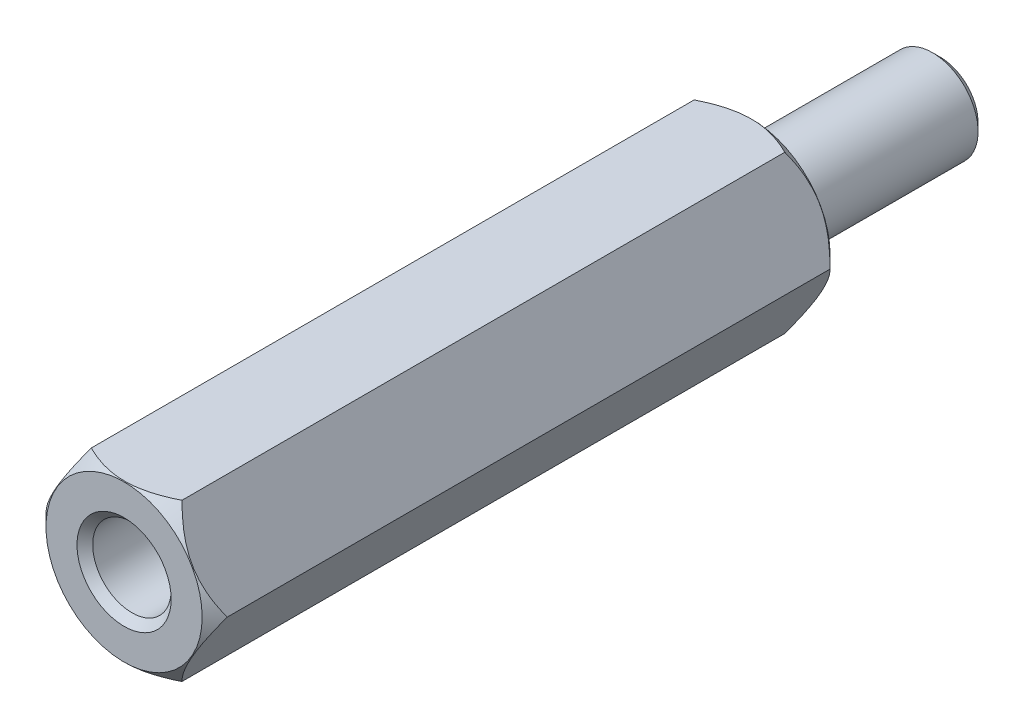
ISO-10303-21;
HEADER;
FILE_DESCRIPTION(('STEP AP214'),'2;1');
FILE_NAME('part.step','',(''),(''),'','','');
FILE_SCHEMA(('AUTOMOTIVE_DESIGN { 1 0 10303 214 1 1 1 1 }'));
ENDSEC;
DATA;
#1=APPLICATION_CONTEXT('core data for automotive mechanical design processes');
#2=APPLICATION_PROTOCOL_DEFINITION('international standard','automotive_design',2000,#1);
#3=PRODUCT_CONTEXT('',#1,'mechanical');
#4=PRODUCT('Part','Part','',(#3));
#5=PRODUCT_RELATED_PRODUCT_CATEGORY('part','',(#4));
#6=PRODUCT_DEFINITION_FORMATION('','',#4);
#7=PRODUCT_DEFINITION_CONTEXT('part definition',#1,'design');
#8=PRODUCT_DEFINITION('design','',#6,#7);
#9=PRODUCT_DEFINITION_SHAPE('','',#8);
#10=(LENGTH_UNIT() NAMED_UNIT(*) SI_UNIT(.MILLI.,.METRE.));
#11=(NAMED_UNIT(*) PLANE_ANGLE_UNIT() SI_UNIT($,.RADIAN.));
#12=(NAMED_UNIT(*) SI_UNIT($,.STERADIAN.) SOLID_ANGLE_UNIT());
#13=UNCERTAINTY_MEASURE_WITH_UNIT(LENGTH_MEASURE(1.E-05),#10,'distance_accuracy_value','');
#14=(GEOMETRIC_REPRESENTATION_CONTEXT(3) GLOBAL_UNCERTAINTY_ASSIGNED_CONTEXT((#13)) GLOBAL_UNIT_ASSIGNED_CONTEXT((#10,
#11,#12)) REPRESENTATION_CONTEXT('',''));
#15=CARTESIAN_POINT('',(0.,0.,0.));
#16=DIRECTION('',(0.,0.,1.));
#17=DIRECTION('',(1.,0.,0.));
#18=AXIS2_PLACEMENT_3D('',#15,#16,#17);
#19=CARTESIAN_POINT('',(0.,0.,10.));
#20=DIRECTION('',(0.,0.,1.));
#21=DIRECTION('',(1.,0.,0.));
#22=AXIS2_PLACEMENT_3D('',#19,#20,#21);
#23=CYLINDRICAL_SURFACE('',#22,1.24999999999999);
#24=CARTESIAN_POINT('',(0.,0.,9.75000000000001));
#25=DIRECTION('',(0.,0.,1.));
#26=DIRECTION('',(1.,0.,0.));
#27=AXIS2_PLACEMENT_3D('',#24,#25,#26);
#28=CIRCLE('',#27,1.24999999999999);
#29=CARTESIAN_POINT('',(1.24999999999999,0.,9.75000000000001));
#30=VERTEX_POINT('',#29);
#31=EDGE_CURVE('E51',#30,#30,#28,.T.);
#32=ORIENTED_EDGE('',*,*,#31,.T.);
#33=EDGE_LOOP('',(#32));
#34=FACE_BOUND('',#33,.T.);
#35=CARTESIAN_POINT('',(0.,0.,-8.));
#36=DIRECTION('',(0.,0.,-1.));
#37=DIRECTION('',(-1.,0.,0.));
#38=AXIS2_PLACEMENT_3D('',#35,#36,#37);
#39=CIRCLE('',#38,1.24999999999999);
#40=CARTESIAN_POINT('',(-1.24999999999999,0.,-8.));
#41=VERTEX_POINT('',#40);
#42=EDGE_CURVE('E118',#41,#41,#39,.F.);
#43=ORIENTED_EDGE('',*,*,#42,.F.);
#44=EDGE_LOOP('',(#43));
#45=FACE_BOUND('',#44,.T.);
#46=ADVANCED_FACE('F41',(#34,#45),#23,.F.);
#47=CARTESIAN_POINT('',(1.44337567297409,-2.49999999999998,10.));
#48=DIRECTION('',(-0.866025403784442,0.499999999999995,0.));
#49=DIRECTION('',(-0.499999999999995,-0.866025403784442,0.));
#50=AXIS2_PLACEMENT_3D('',#47,#48,#49);
#51=PLANE('',#50);
#52=CARTESIAN_POINT('',(1.44326020292026,-2.50019999999999,9.59988452301824));
#53=CARTESIAN_POINT('',(1.49287669073471,-2.41426172221222,9.64945929464527));
#54=CARTESIAN_POINT('',(1.54332283764112,-2.32688643272423,9.69612251863749));
#55=CARTESIAN_POINT('',(1.64618811625262,-2.1487185438344,9.7815618599617));
#56=CARTESIAN_POINT('',(1.69861703122362,-2.05790899931891,9.82029043759399));
#57=CARTESIAN_POINT('',(1.80433744175988,-1.87479587687307,9.88663329610226));
#58=CARTESIAN_POINT('',(1.85760201171318,-1.78253893547065,9.91441433146914));
#59=CARTESIAN_POINT('',(1.96530378549011,-1.5959939912237,9.95721682408933));
#60=CARTESIAN_POINT('',(2.01973769896308,-1.50171168743371,9.97227023332865));
#61=CARTESIAN_POINT('',(2.11355131286834,-1.33922174170815,9.98585227779051));
#62=CARTESIAN_POINT('',(2.15280980880343,-1.27122403211984,9.98786290075919));
#63=CARTESIAN_POINT('',(2.23126263056551,-1.13533975883077,9.98447588281251));
#64=CARTESIAN_POINT('',(2.27045692907359,-1.06745324244775,9.97907564470017));
#65=CARTESIAN_POINT('',(2.34847544336506,-0.932321211763883,9.96117421159752));
#66=CARTESIAN_POINT('',(2.38729919566124,-0.865076500246428,9.94866507295351));
#67=CARTESIAN_POINT('',(2.46427534467605,-0.731749899181788,9.91723249804429));
#68=CARTESIAN_POINT('',(2.50242779262543,-0.66566792090033,9.89830955350318));
#69=CARTESIAN_POINT('',(2.60015256308363,-0.496403653308724,9.84213263859175));
#70=CARTESIAN_POINT('',(2.6591189485299,-0.394270877777098,9.80064416840381));
#71=CARTESIAN_POINT('',(2.74582384890658,-0.244093585059486,9.73060595327691));
#72=CARTESIAN_POINT('',(2.77439698586413,-0.194603460117387,9.70599774788392));
#73=CARTESIAN_POINT('',(2.83101398781794,-0.0965399361611519,9.65453811328476));
#74=CARTESIAN_POINT('',(2.85905816495513,-0.0479659965030718,9.62768806122065));
#75=CARTESIAN_POINT('',(2.88686681600197,0.000199999999999628,9.59988452301824));
#76=B_SPLINE_CURVE_WITH_KNOTS('',3,(#52,#53,#54,#55,#56,#57,#58,#59,#60,#61,#62,#63,#64,#65,#66,
#67,#68,#69,#70,#71,#72,#73,#74,#75),.UNSPECIFIED.,.F.,.F.,(4,2,2,2,2,2,2,2,2,2,2,4),(0.,
0.333012085133922,0.667964518301391,0.99759703204329,1.32639954393843,1.56169424147167,
1.79707142102082,2.0327121352217,2.2683347877565,2.64260240809531,2.82922877818861,
3.01574133749022),.UNSPECIFIED.);
#77=CARTESIAN_POINT('',(1.4433756729741,-2.49999999999999,9.6));
#78=VERTEX_POINT('',#77);
#79=CARTESIAN_POINT('',(2.88675134594813,0.,9.6));
#80=VERTEX_POINT('',#79);
#81=EDGE_CURVE('E95',#78,#80,#76,.T.);
#82=ORIENTED_EDGE('',*,*,#81,.F.);
#83=DIRECTION('',(0.,0.,-1.));
#84=VECTOR('',#83,1.);
#85=CARTESIAN_POINT('',(1.44337567297409,-2.49999999999998,10.));
#86=LINE('',#85,#84);
#87=CARTESIAN_POINT('',(1.44337567297409,-2.49999999999998,-9.60000000000001));
#88=VERTEX_POINT('',#87);
#89=EDGE_CURVE('E66',#78,#88,#86,.T.);
#90=ORIENTED_EDGE('',*,*,#89,.T.);
#91=CARTESIAN_POINT('',(2.88686681600197,0.0002,-9.59988452301824));
#92=CARTESIAN_POINT('',(2.83725032818751,-0.0857382777877641,-9.64945929464528));
#93=CARTESIAN_POINT('',(2.7868041812811,-0.173113567275752,-9.69612251863749));
#94=CARTESIAN_POINT('',(2.68393890266961,-0.351281456165586,-9.7815618599617));
#95=CARTESIAN_POINT('',(2.63150998769861,-0.442091000681072,-9.82029043759399));
#96=CARTESIAN_POINT('',(2.52578957716235,-0.625204123126917,-9.88663329610226));
#97=CARTESIAN_POINT('',(2.47252500720905,-0.717461064529336,-9.91441433146914));
#98=CARTESIAN_POINT('',(2.36482323343211,-0.90400600877628,-9.95721682408933));
#99=CARTESIAN_POINT('',(2.31038931995914,-0.998288312566276,-9.97227023332865));
#100=CARTESIAN_POINT('',(2.21657570605388,-1.16077825829184,-9.98585227779051));
#101=CARTESIAN_POINT('',(2.1773172101188,-1.22877596788014,-9.98786290075919));
#102=CARTESIAN_POINT('',(2.09886438835672,-1.36466024116921,-9.98447588281251));
#103=CARTESIAN_POINT('',(2.05967008984864,-1.43254675755223,-9.97907564470017));
#104=CARTESIAN_POINT('',(1.98165157555716,-1.5676787882361,-9.96117421159752));
#105=CARTESIAN_POINT('',(1.94282782326098,-1.63492349975355,-9.94866507295351));
#106=CARTESIAN_POINT('',(1.86585167424618,-1.76825010081819,-9.91723249804429));
#107=CARTESIAN_POINT('',(1.8276992262968,-1.83433207909965,-9.89830955350318));
#108=CARTESIAN_POINT('',(1.7299744558386,-2.00359634669126,-9.84213263859175));
#109=CARTESIAN_POINT('',(1.67100807039233,-2.10572912222288,-9.80064416840381));
#110=CARTESIAN_POINT('',(1.58430317001565,-2.2559064149405,-9.73060595327691));
#111=CARTESIAN_POINT('',(1.5557300330581,-2.3053965398826,-9.70599774788392));
#112=CARTESIAN_POINT('',(1.49911303110428,-2.40346006383883,-9.65453811328476));
#113=CARTESIAN_POINT('',(1.47106885396709,-2.45203400349691,-9.62768806122065));
#114=CARTESIAN_POINT('',(1.44326020292026,-2.50019999999999,-9.59988452301824));
#115=B_SPLINE_CURVE_WITH_KNOTS('',3,(#91,#92,#93,#94,#95,#96,#97,#98,#99,#100,#101,#102,#103,
#104,#105,#106,#107,#108,#109,#110,#111,#112,#113,#114),.UNSPECIFIED.,.F.,.F.,(4,2,2,2,2,2,2,2,
2,2,2,4),(0.,0.33301208513392,0.667964518301389,0.997597032043288,1.32639954393843,
1.56169424147167,1.79707142102081,2.03271213522169,2.26833478775649,2.64260240809531,
2.82922877818861,3.01574133749022),.UNSPECIFIED.);
#116=CARTESIAN_POINT('',(2.88675134594813,0.,-9.6));
#117=VERTEX_POINT('',#116);
#118=EDGE_CURVE('E116',#117,#88,#115,.T.);
#119=ORIENTED_EDGE('',*,*,#118,.F.);
#120=DIRECTION('',(0.,0.,-1.));
#121=VECTOR('',#120,1.);
#122=CARTESIAN_POINT('',(2.88675134594813,0.,10.));
#123=LINE('',#122,#121);
#124=EDGE_CURVE('E109',#80,#117,#123,.T.);
#125=ORIENTED_EDGE('',*,*,#124,.F.);
#126=EDGE_LOOP('',(#82,#90,#119,#125));
#127=FACE_BOUND('',#126,.T.);
#128=ADVANCED_FACE('F115',(#127),#51,.F.);
#129=CARTESIAN_POINT('',(2.88675134594813,0.,10.));
#130=DIRECTION('',(-0.866025403784438,-0.500000000000001,0.));
#131=DIRECTION('',(0.500000000000001,-0.866025403784438,0.));
#132=AXIS2_PLACEMENT_3D('',#129,#130,#131);
#133=PLANE('',#132);
#134=CARTESIAN_POINT('',(2.88686681600197,-0.000199999999999787,9.59988452301824));
#135=CARTESIAN_POINT('',(2.83725032818751,0.085738277787765,9.64945929464528));
#136=CARTESIAN_POINT('',(2.7868041812811,0.173113567275754,9.6961225186375));
#137=CARTESIAN_POINT('',(2.6839389026696,0.351281456165589,9.7815618599617));
#138=CARTESIAN_POINT('',(2.6315099876986,0.442091000681075,9.820290437594));
#139=CARTESIAN_POINT('',(2.52578957716234,0.625204123126922,9.88663329610226));
#140=CARTESIAN_POINT('',(2.47252500720904,0.717461064529341,9.91441433146915));
#141=CARTESIAN_POINT('',(2.3648232334321,0.904006008776286,9.95721682408934));
#142=CARTESIAN_POINT('',(2.31038931995913,0.998288312566284,9.97227023332866));
#143=CARTESIAN_POINT('',(2.21657570605387,1.16077825829185,9.98585227779052));
#144=CARTESIAN_POINT('',(2.17731721011878,1.22877596788015,9.9878629007592));
#145=CARTESIAN_POINT('',(2.0988643883567,1.36466024116922,9.98447588281252));
#146=CARTESIAN_POINT('',(2.05967008984862,1.43254675755224,9.97907564470018));
#147=CARTESIAN_POINT('',(1.98165157555715,1.56767878823611,9.96117421159753));
#148=CARTESIAN_POINT('',(1.94282782326097,1.63492349975356,9.94866507295352));
#149=CARTESIAN_POINT('',(1.86585167424616,1.7682501008182,9.9172324980443));
#150=CARTESIAN_POINT('',(1.82769922629678,1.83433207909966,9.89830955350319));
#151=CARTESIAN_POINT('',(1.72997445583858,2.00359634669127,9.84213263859176));
#152=CARTESIAN_POINT('',(1.67100807039231,2.1057291222229,9.80064416840382));
#153=CARTESIAN_POINT('',(1.58430317001562,2.25590641494051,9.73060595327692));
#154=CARTESIAN_POINT('',(1.55573003305807,2.30539653988261,9.70599774788393));
#155=CARTESIAN_POINT('',(1.49911303110425,2.40346006383885,9.65453811328477));
#156=CARTESIAN_POINT('',(1.47106885396706,2.45203400349693,9.62768806122065));
#157=CARTESIAN_POINT('',(1.44326020292022,2.50020000000001,9.59988452301824));
#158=B_SPLINE_CURVE_WITH_KNOTS('',3,(#134,#135,#136,#137,#138,#139,#140,#141,#142,#143,#144,
#145,#146,#147,#148,#149,#150,#151,#152,#153,#154,#155,#156,#157),.UNSPECIFIED.,.F.,.F.,(4,2,2,
2,2,2,2,2,2,2,2,4),(0.,0.333012085133925,0.667964518301398,0.9975970320433,1.32639954393844,
1.56169424147169,1.79707142102083,2.03271213522171,2.26833478775651,2.64260240809534,
2.82922877818864,3.01574133749026),.UNSPECIFIED.);
#159=CARTESIAN_POINT('',(1.44337567297406,2.50000000000001,9.6));
#160=VERTEX_POINT('',#159);
#161=EDGE_CURVE('E98',#80,#160,#158,.T.);
#162=ORIENTED_EDGE('',*,*,#161,.F.);
#163=ORIENTED_EDGE('',*,*,#124,.T.);
#164=CARTESIAN_POINT('',(1.44326020292022,2.50020000000001,-9.59988452301824));
#165=CARTESIAN_POINT('',(1.49287669073468,2.41426172221224,-9.64945929464528));
#166=CARTESIAN_POINT('',(1.54332283764109,2.32688643272425,-9.6961225186375));
#167=CARTESIAN_POINT('',(1.64618811625259,2.14871854383442,-9.7815618599617));
#168=CARTESIAN_POINT('',(1.69861703122359,2.05790899931893,-9.820290437594));
#169=CARTESIAN_POINT('',(1.80433744175985,1.87479587687308,-9.88663329610226));
#170=CARTESIAN_POINT('',(1.85760201171315,1.78253893547066,-9.91441433146915));
#171=CARTESIAN_POINT('',(1.96530378549009,1.59599399122372,-9.95721682408934));
#172=CARTESIAN_POINT('',(2.01973769896306,1.50171168743372,-9.97227023332866));
#173=CARTESIAN_POINT('',(2.11355131286832,1.33922174170816,-9.98585227779052));
#174=CARTESIAN_POINT('',(2.15280980880341,1.27122403211985,-9.9878629007592));
#175=CARTESIAN_POINT('',(2.23126263056549,1.13533975883079,-9.98447588281252));
#176=CARTESIAN_POINT('',(2.27045692907357,1.06745324244777,-9.97907564470018));
#177=CARTESIAN_POINT('',(2.34847544336504,0.932321211763899,-9.96117421159753));
#178=CARTESIAN_POINT('',(2.38729919566123,0.865076500246445,-9.94866507295352));
#179=CARTESIAN_POINT('',(2.46427534467603,0.731749899181806,-9.9172324980443));
#180=CARTESIAN_POINT('',(2.50242779262542,0.665667920900348,-9.89830955350319));
#181=CARTESIAN_POINT('',(2.60015256308362,0.49640365330874,-9.84213263859176));
#182=CARTESIAN_POINT('',(2.65911894852989,0.394270877777111,-9.80064416840382));
#183=CARTESIAN_POINT('',(2.74582384890657,0.244093585059494,-9.73060595327692));
#184=CARTESIAN_POINT('',(2.77439698586412,0.194603460117393,-9.70599774788393));
#185=CARTESIAN_POINT('',(2.83101398781794,0.0965399361611548,-9.65453811328477));
#186=CARTESIAN_POINT('',(2.85905816495513,0.0479659965030731,-9.62768806122065));
#187=CARTESIAN_POINT('',(2.88686681600197,-0.000199999999999539,-9.59988452301824));
#188=B_SPLINE_CURVE_WITH_KNOTS('',3,(#164,#165,#166,#167,#168,#169,#170,#171,#172,#173,#174,
#175,#176,#177,#178,#179,#180,#181,#182,#183,#184,#185,#186,#187),.UNSPECIFIED.,.F.,.F.,(4,2,2,
2,2,2,2,2,2,2,2,4),(0.,0.333012085133926,0.6679645183014,0.997597032043303,1.32639954393845,
1.56169424147169,1.79707142102083,2.03271213522171,2.26833478775651,2.64260240809534,
2.82922877818864,3.01574133749026),.UNSPECIFIED.);
#189=CARTESIAN_POINT('',(1.44337567297406,2.50000000000001,-9.6));
#190=VERTEX_POINT('',#189);
#191=EDGE_CURVE('E251',#190,#117,#188,.T.);
#192=ORIENTED_EDGE('',*,*,#191,.F.);
#193=DIRECTION('',(0.,0.,-1.));
#194=VECTOR('',#193,1.);
#195=CARTESIAN_POINT('',(1.44337567297406,2.50000000000001,10.));
#196=LINE('',#195,#194);
#197=EDGE_CURVE('E111',#160,#190,#196,.T.);
#198=ORIENTED_EDGE('',*,*,#197,.F.);
#199=EDGE_LOOP('',(#162,#163,#192,#198));
#200=FACE_BOUND('',#199,.T.);
#201=ADVANCED_FACE('F107',(#200),#133,.F.);
#202=CARTESIAN_POINT('',(1.44337567297406,2.50000000000001,10.));
#203=DIRECTION('',(0.,-1.,0.));
#204=DIRECTION('',(1.,0.,0.));
#205=AXIS2_PLACEMENT_3D('',#202,#203,#204);
#206=PLANE('',#205);
#207=CARTESIAN_POINT('',(4.35790807222665,2.50000000000002,7.46267304580409));
#208=CARTESIAN_POINT('',(4.22900505074815,2.50000000000001,7.57444020651168));
#209=CARTESIAN_POINT('',(4.09952897907173,2.50000000000001,7.68556009439584));
#210=CARTESIAN_POINT('',(3.83898638028681,2.50000000000001,7.90604374915114));
#211=CARTESIAN_POINT('',(3.70791912620545,2.50000000000001,8.01540665588043));
#212=CARTESIAN_POINT('',(3.44083760855067,2.50000000000001,8.23429407491961));
#213=CARTESIAN_POINT('',(3.30477887797079,2.50000000000001,8.34376454299069));
#214=CARTESIAN_POINT('',(3.03009587684347,2.50000000000001,8.55938263287972));
#215=CARTESIAN_POINT('',(2.89147225782007,2.50000000000001,8.6655310805966));
#216=CARTESIAN_POINT('',(2.61062429451692,2.50000000000001,8.87338578520497));
#217=CARTESIAN_POINT('',(2.46839537969833,2.50000000000001,8.97508590704005));
#218=CARTESIAN_POINT('',(2.17925486790779,2.50000000000001,9.17194970638112));
#219=CARTESIAN_POINT('',(2.03233957265131,2.50000000000001,9.26710802470617));
#220=CARTESIAN_POINT('',(1.73361597358268,2.50000000000001,9.44680833734888));
#221=CARTESIAN_POINT('',(1.58185407011246,2.50000000000001,9.5314264527755));
#222=CARTESIAN_POINT('',(1.27084130527911,2.5,9.68552599595446));
#223=CARTESIAN_POINT('',(1.11160488303032,2.5,9.75503525688873));
#224=CARTESIAN_POINT('',(0.864657376231804,2.5,9.84259642513528));
#225=CARTESIAN_POINT('',(0.77999302622252,2.5,9.86920046305057));
#226=CARTESIAN_POINT('',(0.608668935092173,2.5,9.91504582346073));
#227=CARTESIAN_POINT('',(0.522009514777892,2.5,9.93428832104285));
#228=CARTESIAN_POINT('',(0.347739556932336,2.5,9.9641318069513));
#229=CARTESIAN_POINT('',(0.260138222188822,2.5,9.97478552783329));
#230=CARTESIAN_POINT('',(0.0842961272603139,2.5,9.98686770307153));
#231=CARTESIAN_POINT('',(-0.00394456438844589,2.5,9.98829713200226));
#232=CARTESIAN_POINT('',(-0.180192018780213,2.5,9.98181608276146));
#233=CARTESIAN_POINT('',(-0.268198313940587,2.5,9.97389317264444));
#234=CARTESIAN_POINT('',(-0.442968473014178,2.5,9.94928693602144));
#235=CARTESIAN_POINT('',(-0.529732088460509,2.5,9.93260188201526));
#236=CARTESIAN_POINT('',(-0.70200364163614,2.5,9.89141807606219));
#237=CARTESIAN_POINT('',(-0.787498274243356,2.5,9.86686463906262));
#238=CARTESIAN_POINT('',(-0.956318998116786,2.5,9.81127227919823));
#239=CARTESIAN_POINT('',(-1.03964506444263,2.5,9.78023328178095));
#240=CARTESIAN_POINT('',(-1.22260914379837,2.5,9.70532752613879));
#241=CARTESIAN_POINT('',(-1.32170415747565,2.5,9.66014559308747));
#242=CARTESIAN_POINT('',(-1.51694385371061,2.49999999999999,9.56375515379207));
#243=CARTESIAN_POINT('',(-1.61308679170487,2.49999999999999,9.51254316726495));
#244=CARTESIAN_POINT('',(-1.80296614219631,2.49999999999999,9.40543166741101));
#245=CARTESIAN_POINT('',(-1.89669715950609,2.49999999999999,9.34952266760245));
#246=CARTESIAN_POINT('',(-2.08192800240941,2.49999999999999,9.23418674307865));
#247=CARTESIAN_POINT('',(-2.17342826625815,2.49999999999999,9.17476051735267));
#248=CARTESIAN_POINT('',(-2.35505847652762,2.49999999999999,9.05284030367592));
#249=CARTESIAN_POINT('',(-2.44517856997304,2.49999999999999,8.99033170499245));
#250=CARTESIAN_POINT('',(-2.62385919422449,2.49999999999999,8.86311875000847));
#251=CARTESIAN_POINT('',(-2.71241960671455,2.49999999999999,8.79841422820775));
#252=CARTESIAN_POINT('',(-2.97593968609535,2.49999999999999,8.60184992046111));
#253=CARTESIAN_POINT('',(-3.14895696314842,2.49999999999999,8.46738929484149));
#254=CARTESIAN_POINT('',(-3.49727644035017,2.49999999999999,8.18911816701068));
#255=CARTESIAN_POINT('',(-3.6724475097082,2.49999999999999,8.04514512901893));
#256=CARTESIAN_POINT('',(-3.9321211000153,2.49999999999999,7.82741624538674));
#257=CARTESIAN_POINT('',(-4.01770626505476,2.49999999999999,7.75494531232854));
#258=CARTESIAN_POINT('',(-4.18824952148341,2.49999999999999,7.60930608888149));
#259=CARTESIAN_POINT('',(-4.2732077442148,2.49999999999999,7.53613795236393));
#260=CARTESIAN_POINT('',(-4.35790807222667,2.49999999999999,7.46267304580409));
#261=B_SPLINE_CURVE_WITH_KNOTS('',3,(#207,#208,#209,#210,#211,#212,#213,#214,#215,#216,#217,
#218,#219,#220,#221,#222,#223,#224,#225,#226,#227,#228,#229,#230,#231,#232,#233,#234,#235,#236,
#237,#238,#239,#240,#241,#242,#243,#244,#245,#246,#247,#248,#249,#250,#251,#252,#253,#254,#255,
#256,#257,#258,#259,#260),.UNSPECIFIED.,.F.,.F.,(4,2,2,2,2,2,2,2,2,2,2,2,2,2,2,2,2,2,2,2,2,2,2,
2,2,2,4),(0.,0.511842212813337,1.02392780167291,1.54778169920521,2.0715043079768,
2.59592780979257,3.12077593308527,3.6415817306556,4.16141982425733,4.42739176689035,
4.69332123596952,4.95760526901695,5.22186137919605,5.4864691576042,5.75112912434679,
6.01766988465734,6.28421370906123,6.61066447125655,6.93730457870706,7.26462103112129,
7.59187265192317,7.92086150920113,8.24987521669916,8.90710736338424,9.58728616124552,
9.92372274140157,10.2600867154781),.UNSPECIFIED.);
#262=CARTESIAN_POINT('',(-1.44337567297408,2.5,9.6));
#263=VERTEX_POINT('',#262);
#264=EDGE_CURVE('E113',#160,#263,#261,.T.);
#265=ORIENTED_EDGE('',*,*,#264,.F.);
#266=ORIENTED_EDGE('',*,*,#197,.T.);
#267=CARTESIAN_POINT('',(-4.35790807222667,2.49999999999999,-7.46267304580409));
#268=CARTESIAN_POINT('',(-4.22900505074817,2.49999999999999,-7.57444020651168));
#269=CARTESIAN_POINT('',(-4.09952897907174,2.49999999999999,-7.68556009439584));
#270=CARTESIAN_POINT('',(-3.83898638028682,2.49999999999999,-7.90604374915114));
#271=CARTESIAN_POINT('',(-3.70791912620547,2.49999999999999,-8.01540665588043));
#272=CARTESIAN_POINT('',(-3.44083760855069,2.49999999999999,-8.23429407491961));
#273=CARTESIAN_POINT('',(-3.30477887797081,2.49999999999999,-8.34376454299069));
#274=CARTESIAN_POINT('',(-3.03009587684349,2.49999999999999,-8.55938263287972));
#275=CARTESIAN_POINT('',(-2.89147225782008,2.49999999999999,-8.6655310805966));
#276=CARTESIAN_POINT('',(-2.61062429451694,2.49999999999999,-8.87338578520497));
#277=CARTESIAN_POINT('',(-2.46839537969835,2.49999999999999,-8.97508590704005));
#278=CARTESIAN_POINT('',(-2.17925486790781,2.49999999999999,-9.17194970638112));
#279=CARTESIAN_POINT('',(-2.03233957265133,2.49999999999999,-9.26710802470617));
#280=CARTESIAN_POINT('',(-1.7336159735827,2.49999999999999,-9.44680833734888));
#281=CARTESIAN_POINT('',(-1.58185407011247,2.49999999999999,-9.5314264527755));
#282=CARTESIAN_POINT('',(-1.27084130527912,2.5,-9.68552599595446));
#283=CARTESIAN_POINT('',(-1.11160488303033,2.5,-9.75503525688873));
#284=CARTESIAN_POINT('',(-0.864657376231821,2.5,-9.84259642513528));
#285=CARTESIAN_POINT('',(-0.779993026222537,2.5,-9.86920046305057));
#286=CARTESIAN_POINT('',(-0.608668935092189,2.5,-9.91504582346073));
#287=CARTESIAN_POINT('',(-0.522009514777909,2.5,-9.93428832104285));
#288=CARTESIAN_POINT('',(-0.347739556932353,2.5,-9.9641318069513));
#289=CARTESIAN_POINT('',(-0.260138222188839,2.5,-9.97478552783329));
#290=CARTESIAN_POINT('',(-0.0842961272603305,2.5,-9.98686770307153));
#291=CARTESIAN_POINT('',(0.0039445643884292,2.5,-9.98829713200226));
#292=CARTESIAN_POINT('',(0.180192018780197,2.5,-9.98181608276146));
#293=CARTESIAN_POINT('',(0.26819831394057,2.5,-9.97389317264444));
#294=CARTESIAN_POINT('',(0.442968473014161,2.5,-9.94928693602144));
#295=CARTESIAN_POINT('',(0.529732088460492,2.5,-9.93260188201526));
#296=CARTESIAN_POINT('',(0.702003641636123,2.5,-9.89141807606219));
#297=CARTESIAN_POINT('',(0.78749827424334,2.5,-9.86686463906262));
#298=CARTESIAN_POINT('',(0.956318998116769,2.5,-9.81127227919823));
#299=CARTESIAN_POINT('',(1.03964506444261,2.5,-9.78023328178095));
#300=CARTESIAN_POINT('',(1.22260914379835,2.5,-9.70532752613879));
#301=CARTESIAN_POINT('',(1.32170415747563,2.5,-9.66014559308747));
#302=CARTESIAN_POINT('',(1.51694385371059,2.50000000000001,-9.56375515379207));
#303=CARTESIAN_POINT('',(1.61308679170485,2.50000000000001,-9.51254316726495));
#304=CARTESIAN_POINT('',(1.80296614219629,2.50000000000001,-9.40543166741101));
#305=CARTESIAN_POINT('',(1.89669715950607,2.50000000000001,-9.34952266760245));
#306=CARTESIAN_POINT('',(2.08192800240939,2.50000000000001,-9.23418674307865));
#307=CARTESIAN_POINT('',(2.17342826625813,2.50000000000001,-9.17476051735267));
#308=CARTESIAN_POINT('',(2.3550584765276,2.50000000000001,-9.05284030367592));
#309=CARTESIAN_POINT('',(2.44517856997302,2.50000000000001,-8.99033170499245));
#310=CARTESIAN_POINT('',(2.62385919422447,2.50000000000001,-8.86311875000847));
#311=CARTESIAN_POINT('',(2.71241960671454,2.50000000000001,-8.79841422820775));
#312=CARTESIAN_POINT('',(2.97593968609533,2.50000000000001,-8.60184992046111));
#313=CARTESIAN_POINT('',(3.14895696314841,2.50000000000001,-8.46738929484149));
#314=CARTESIAN_POINT('',(3.49727644035015,2.50000000000001,-8.18911816701068));
#315=CARTESIAN_POINT('',(3.67244750970818,2.50000000000001,-8.04514512901893));
#316=CARTESIAN_POINT('',(3.93212110001529,2.50000000000001,-7.82741624538673));
#317=CARTESIAN_POINT('',(4.01770626505474,2.50000000000001,-7.75494531232854));
#318=CARTESIAN_POINT('',(4.18824952148339,2.50000000000001,-7.60930608888149));
#319=CARTESIAN_POINT('',(4.27320774421478,2.50000000000001,-7.53613795236393));
#320=CARTESIAN_POINT('',(4.35790807222665,2.50000000000002,-7.46267304580409));
#321=B_SPLINE_CURVE_WITH_KNOTS('',3,(#267,#268,#269,#270,#271,#272,#273,#274,#275,#276,#277,
#278,#279,#280,#281,#282,#283,#284,#285,#286,#287,#288,#289,#290,#291,#292,#293,#294,#295,#296,
#297,#298,#299,#300,#301,#302,#303,#304,#305,#306,#307,#308,#309,#310,#311,#312,#313,#314,#315,
#316,#317,#318,#319,#320),.UNSPECIFIED.,.F.,.F.,(4,2,2,2,2,2,2,2,2,2,2,2,2,2,2,2,2,2,2,2,2,2,2,
2,2,2,4),(0.,0.511842212813336,1.02392780167291,1.54778169920521,2.0715043079768,
2.59592780979257,3.12077593308528,3.6415817306556,4.16141982425734,4.42739176689035,
4.69332123596952,4.95760526901695,5.22186137919605,5.4864691576042,5.75112912434679,
6.01766988465734,6.28421370906123,6.61066447125655,6.93730457870706,7.2646210311213,
7.59187265192318,7.92086150920113,8.24987521669917,8.90710736338424,9.58728616124552,
9.92372274140157,10.2600867154781),.UNSPECIFIED.);
#322=CARTESIAN_POINT('',(-1.44337567297408,2.5,-9.6));
#323=VERTEX_POINT('',#322);
#324=EDGE_CURVE('E259',#323,#190,#321,.T.);
#325=ORIENTED_EDGE('',*,*,#324,.F.);
#326=DIRECTION('',(0.,0.,-1.));
#327=VECTOR('',#326,1.);
#328=CARTESIAN_POINT('',(-1.44337567297408,2.5,10.));
#329=LINE('',#328,#327);
#330=EDGE_CURVE('E127',#263,#323,#329,.T.);
#331=ORIENTED_EDGE('',*,*,#330,.F.);
#332=EDGE_LOOP('',(#265,#266,#325,#331));
#333=FACE_BOUND('',#332,.T.);
#334=ADVANCED_FACE('F245',(#333),#206,.F.);
#335=CARTESIAN_POINT('',(-1.44337567297408,2.5,10.));
#336=DIRECTION('',(0.866025403784442,-0.499999999999995,0.));
#337=DIRECTION('',(0.499999999999995,0.866025403784442,0.));
#338=AXIS2_PLACEMENT_3D('',#335,#336,#337);
#339=PLANE('',#338);
#340=CARTESIAN_POINT('',(-1.44326020292024,2.5002,9.59988452301824));
#341=CARTESIAN_POINT('',(-1.4928766907347,2.41426172221223,9.64945929464528));
#342=CARTESIAN_POINT('',(-1.54332283764111,2.32688643272424,9.6961225186375));
#343=CARTESIAN_POINT('',(-1.6461881162526,2.14871854383441,9.7815618599617));
#344=CARTESIAN_POINT('',(-1.6986170312236,2.05790899931892,9.820290437594));
#345=CARTESIAN_POINT('',(-1.80433744175987,1.87479587687307,9.88663329610226));
#346=CARTESIAN_POINT('',(-1.85760201171316,1.78253893547065,9.91441433146915));
#347=CARTESIAN_POINT('',(-1.9653037854901,1.5959939912237,9.95721682408934));
#348=CARTESIAN_POINT('',(-2.01973769896307,1.50171168743371,9.97227023332866));
#349=CARTESIAN_POINT('',(-2.11355131286833,1.33922174170814,9.98585227779052));
#350=CARTESIAN_POINT('',(-2.15280980880342,1.27122403211984,9.9878629007592));
#351=CARTESIAN_POINT('',(-2.2312626305655,1.13533975883077,9.98447588281252));
#352=CARTESIAN_POINT('',(-2.27045692907358,1.06745324244775,9.97907564470018));
#353=CARTESIAN_POINT('',(-2.34847544336505,0.932321211763883,9.96117421159753));
#354=CARTESIAN_POINT('',(-2.38729919566123,0.865076500246428,9.94866507295352));
#355=CARTESIAN_POINT('',(-2.46427534467604,0.731749899181789,9.9172324980443));
#356=CARTESIAN_POINT('',(-2.50242779262542,0.665667920900331,9.89830955350319));
#357=CARTESIAN_POINT('',(-2.60015256308362,0.496403653308722,9.84213263859176));
#358=CARTESIAN_POINT('',(-2.65911894852989,0.394270877777092,9.80064416840382));
#359=CARTESIAN_POINT('',(-2.74582384890657,0.244093585059475,9.73060595327692));
#360=CARTESIAN_POINT('',(-2.77439698586412,0.194603460117374,9.70599774788393));
#361=CARTESIAN_POINT('',(-2.83101398781794,0.0965399361611354,9.65453811328477));
#362=CARTESIAN_POINT('',(-2.85905816495513,0.0479659965030536,9.62768806122065));
#363=CARTESIAN_POINT('',(-2.88686681600197,-0.000200000000019625,9.59988452301824));
#364=B_SPLINE_CURVE_WITH_KNOTS('',3,(#340,#341,#342,#343,#344,#345,#346,#347,#348,#349,#350,
#351,#352,#353,#354,#355,#356,#357,#358,#359,#360,#361,#362,#363),.UNSPECIFIED.,.F.,.F.,(4,2,2,
2,2,2,2,2,2,2,2,4),(0.,0.333012085133925,0.667964518301399,0.997597032043302,1.32639954393845,
1.56169424147169,1.79707142102083,2.03271213522171,2.26833478775651,2.64260240809534,
2.82922877818864,3.01574133749026),.UNSPECIFIED.);
#365=CARTESIAN_POINT('',(-2.88675134594813,0.,9.6));
#366=VERTEX_POINT('',#365);
#367=EDGE_CURVE('E223',#263,#366,#364,.T.);
#368=ORIENTED_EDGE('',*,*,#367,.F.);
#369=ORIENTED_EDGE('',*,*,#330,.T.);
#370=CARTESIAN_POINT('',(-2.88686681600197,-0.000200000000020158,-9.59988452301824));
#371=CARTESIAN_POINT('',(-2.83725032818751,0.0857382777877453,-9.64945929464528));
#372=CARTESIAN_POINT('',(-2.7868041812811,0.173113567275734,-9.6961225186375));
#373=CARTESIAN_POINT('',(-2.68393890266961,0.351281456165571,-9.7815618599617));
#374=CARTESIAN_POINT('',(-2.6315099876986,0.442091000681057,-9.820290437594));
#375=CARTESIAN_POINT('',(-2.52578957716234,0.625204123126904,-9.88663329610226));
#376=CARTESIAN_POINT('',(-2.47252500720904,0.717461064529324,-9.91441433146915));
#377=CARTESIAN_POINT('',(-2.36482323343211,0.90400600877627,-9.95721682408934));
#378=CARTESIAN_POINT('',(-2.31038931995913,0.998288312566268,-9.97227023332866));
#379=CARTESIAN_POINT('',(-2.21657570605388,1.16077825829183,-9.98585227779052));
#380=CARTESIAN_POINT('',(-2.17731721011879,1.22877596788014,-9.9878629007592));
#381=CARTESIAN_POINT('',(-2.09886438835671,1.3646602411692,-9.98447588281252));
#382=CARTESIAN_POINT('',(-2.05967008984863,1.43254675755222,-9.97907564470018));
#383=CARTESIAN_POINT('',(-1.98165157555716,1.56767878823609,-9.96117421159753));
#384=CARTESIAN_POINT('',(-1.94282782326098,1.63492349975355,-9.94866507295352));
#385=CARTESIAN_POINT('',(-1.86585167424617,1.76825010081819,-9.9172324980443));
#386=CARTESIAN_POINT('',(-1.82769922629679,1.83433207909964,-9.89830955350319));
#387=CARTESIAN_POINT('',(-1.72997445583859,2.00359634669125,-9.84213263859176));
#388=CARTESIAN_POINT('',(-1.67100807039232,2.10572912222288,-9.80064416840382));
#389=CARTESIAN_POINT('',(-1.58430317001564,2.2559064149405,-9.73060595327692));
#390=CARTESIAN_POINT('',(-1.55573003305809,2.3053965398826,-9.70599774788393));
#391=CARTESIAN_POINT('',(-1.49911303110427,2.40346006383884,-9.65453811328477));
#392=CARTESIAN_POINT('',(-1.47106885396707,2.45203400349692,-9.62768806122065));
#393=CARTESIAN_POINT('',(-1.44326020292024,2.5002,-9.59988452301824));
#394=B_SPLINE_CURVE_WITH_KNOTS('',3,(#370,#371,#372,#373,#374,#375,#376,#377,#378,#379,#380,
#381,#382,#383,#384,#385,#386,#387,#388,#389,#390,#391,#392,#393),.UNSPECIFIED.,.F.,.F.,(4,2,2,
2,2,2,2,2,2,2,2,4),(0.,0.333012085133925,0.667964518301398,0.997597032043301,1.32639954393844,
1.56169424147169,1.79707142102083,2.03271213522171,2.26833478775651,2.64260240809534,
2.82922877818864,3.01574133749026),.UNSPECIFIED.);
#395=CARTESIAN_POINT('',(-2.88675134594813,0.,-9.6));
#396=VERTEX_POINT('',#395);
#397=EDGE_CURVE('E286',#396,#323,#394,.T.);
#398=ORIENTED_EDGE('',*,*,#397,.F.);
#399=DIRECTION('',(0.,0.,-1.));
#400=VECTOR('',#399,1.);
#401=CARTESIAN_POINT('',(-2.88675134594813,0.,10.));
#402=LINE('',#401,#400);
#403=EDGE_CURVE('E276',#366,#396,#402,.T.);
#404=ORIENTED_EDGE('',*,*,#403,.F.);
#405=EDGE_LOOP('',(#368,#369,#398,#404));
#406=FACE_BOUND('',#405,.T.);
#407=ADVANCED_FACE('F284',(#406),#339,.F.);
#408=CARTESIAN_POINT('',(-2.88675134594813,0.,10.));
#409=DIRECTION('',(0.866025403784435,0.500000000000007,0.));
#410=DIRECTION('',(-0.500000000000007,0.866025403784435,0.));
#411=AXIS2_PLACEMENT_3D('',#408,#409,#410);
#412=PLANE('',#411);
#413=CARTESIAN_POINT('',(-2.88686681600197,0.000199999999979628,9.59988452301824));
#414=CARTESIAN_POINT('',(-2.83725032818751,-0.0857382777877848,9.64945929464528));
#415=CARTESIAN_POINT('',(-2.7868041812811,-0.173113567275773,9.6961225186375));
#416=CARTESIAN_POINT('',(-2.6839389026696,-0.351281456165609,9.7815618599617));
#417=CARTESIAN_POINT('',(-2.6315099876986,-0.442091000681095,9.820290437594));
#418=CARTESIAN_POINT('',(-2.52578957716233,-0.625204123126941,9.88663329610226));
#419=CARTESIAN_POINT('',(-2.47252500720903,-0.71746106452936,9.91441433146915));
#420=CARTESIAN_POINT('',(-2.36482323343209,-0.904006008776305,9.95721682408934));
#421=CARTESIAN_POINT('',(-2.31038931995912,-0.998288312566302,9.97227023332866));
#422=CARTESIAN_POINT('',(-2.21657570605386,-1.16077825829186,9.98585227779052));
#423=CARTESIAN_POINT('',(-2.17731721011877,-1.22877596788017,9.9878629007592));
#424=CARTESIAN_POINT('',(-2.09886438835669,-1.36466024116924,9.98447588281252));
#425=CARTESIAN_POINT('',(-2.05967008984861,-1.43254675755225,9.97907564470018));
#426=CARTESIAN_POINT('',(-1.98165157555713,-1.56767878823612,9.96117421159753));
#427=CARTESIAN_POINT('',(-1.94282782326095,-1.63492349975358,9.94866507295352));
#428=CARTESIAN_POINT('',(-1.86585167424615,-1.76825010081821,9.9172324980443));
#429=CARTESIAN_POINT('',(-1.82769922629676,-1.83433207909967,9.89830955350319));
#430=CARTESIAN_POINT('',(-1.72997445583856,-2.00359634669128,9.84213263859176));
#431=CARTESIAN_POINT('',(-1.67100807039229,-2.10572912222291,9.80064416840382));
#432=CARTESIAN_POINT('',(-1.5843031700156,-2.25590641494052,9.73060595327692));
#433=CARTESIAN_POINT('',(-1.55573003305805,-2.30539653988262,9.70599774788393));
#434=CARTESIAN_POINT('',(-1.49911303110424,-2.40346006383886,9.65453811328477));
#435=CARTESIAN_POINT('',(-1.47106885396704,-2.45203400349694,9.62768806122065));
#436=CARTESIAN_POINT('',(-1.4432602029202,-2.50020000000001,9.59988452301824));
#437=B_SPLINE_CURVE_WITH_KNOTS('',3,(#413,#414,#415,#416,#417,#418,#419,#420,#421,#422,#423,
#424,#425,#426,#427,#428,#429,#430,#431,#432,#433,#434,#435,#436),.UNSPECIFIED.,.F.,.F.,(4,2,2,
2,2,2,2,2,2,2,2,4),(0.,0.333012085133925,0.667964518301399,0.997597032043303,1.32639954393845,
1.56169424147169,1.79707142102083,2.03271213522171,2.26833478775651,2.64260240809534,
2.82922877818864,3.01574133749025),.UNSPECIFIED.);
#438=CARTESIAN_POINT('',(-1.44337567297404,-2.50000000000001,9.6));
#439=VERTEX_POINT('',#438);
#440=EDGE_CURVE('E58',#366,#439,#437,.T.);
#441=ORIENTED_EDGE('',*,*,#440,.F.);
#442=ORIENTED_EDGE('',*,*,#403,.T.);
#443=CARTESIAN_POINT('',(-1.4432602029202,-2.50020000000001,-9.59988452301824));
#444=CARTESIAN_POINT('',(-1.49287669073466,-2.41426172221225,-9.64945929464528));
#445=CARTESIAN_POINT('',(-1.54332283764108,-2.32688643272426,-9.6961225186375));
#446=CARTESIAN_POINT('',(-1.64618811625257,-2.14871854383443,-9.7815618599617));
#447=CARTESIAN_POINT('',(-1.69861703122358,-2.05790899931894,-9.820290437594));
#448=CARTESIAN_POINT('',(-1.80433744175984,-1.8747958768731,-9.88663329610226));
#449=CARTESIAN_POINT('',(-1.85760201171314,-1.78253893547068,-9.91441433146915));
#450=CARTESIAN_POINT('',(-1.96530378549008,-1.59599399122373,-9.95721682408934));
#451=CARTESIAN_POINT('',(-2.01973769896305,-1.50171168743373,-9.97227023332866));
#452=CARTESIAN_POINT('',(-2.11355131286831,-1.33922174170817,-9.98585227779052));
#453=CARTESIAN_POINT('',(-2.1528098088034,-1.27122403211987,-9.9878629007592));
#454=CARTESIAN_POINT('',(-2.23126263056548,-1.1353397588308,-9.98447588281252));
#455=CARTESIAN_POINT('',(-2.27045692907357,-1.06745324244778,-9.97907564470018));
#456=CARTESIAN_POINT('',(-2.34847544336504,-0.932321211763915,-9.96117421159753));
#457=CARTESIAN_POINT('',(-2.38729919566122,-0.865076500246461,-9.94866507295352));
#458=CARTESIAN_POINT('',(-2.46427534467603,-0.731749899181823,-9.9172324980443));
#459=CARTESIAN_POINT('',(-2.50242779262541,-0.665667920900365,-9.89830955350319));
#460=CARTESIAN_POINT('',(-2.60015256308361,-0.496403653308758,-9.84213263859176));
#461=CARTESIAN_POINT('',(-2.65911894852988,-0.394270877777129,-9.80064416840382));
#462=CARTESIAN_POINT('',(-2.74582384890657,-0.244093585059513,-9.73060595327692));
#463=CARTESIAN_POINT('',(-2.77439698586412,-0.194603460117412,-9.70599774788393));
#464=CARTESIAN_POINT('',(-2.83101398781794,-0.0965399361611742,-9.65453811328477));
#465=CARTESIAN_POINT('',(-2.85905816495513,-0.0479659965030929,-9.62768806122065));
#466=CARTESIAN_POINT('',(-2.88686681600197,0.00019999999997943,-9.59988452301824));
#467=B_SPLINE_CURVE_WITH_KNOTS('',3,(#443,#444,#445,#446,#447,#448,#449,#450,#451,#452,#453,
#454,#455,#456,#457,#458,#459,#460,#461,#462,#463,#464,#465,#466),.UNSPECIFIED.,.F.,.F.,(4,2,2,
2,2,2,2,2,2,2,2,4),(0.,0.333012085133925,0.667964518301398,0.997597032043302,1.32639954393845,
1.56169424147169,1.79707142102083,2.03271213522171,2.26833478775651,2.64260240809533,
2.82922877818864,3.01574133749025),.UNSPECIFIED.);
#468=CARTESIAN_POINT('',(-1.44337567297404,-2.50000000000002,-9.6));
#469=VERTEX_POINT('',#468);
#470=EDGE_CURVE('E294',#469,#396,#467,.T.);
#471=ORIENTED_EDGE('',*,*,#470,.F.);
#472=DIRECTION('',(0.,0.,-1.));
#473=VECTOR('',#472,1.);
#474=CARTESIAN_POINT('',(-1.44337567297404,-2.50000000000001,10.));
#475=LINE('',#474,#473);
#476=EDGE_CURVE('E273',#439,#469,#475,.T.);
#477=ORIENTED_EDGE('',*,*,#476,.F.);
#478=EDGE_LOOP('',(#441,#442,#471,#477));
#479=FACE_BOUND('',#478,.T.);
#480=ADVANCED_FACE('F184',(#479),#412,.F.);
#481=CARTESIAN_POINT('',(-1.44337567297404,-2.50000000000001,10.));
#482=DIRECTION('',(0.,1.,0.));
#483=DIRECTION('',(-1.,0.,0.));
#484=AXIS2_PLACEMENT_3D('',#481,#482,#483);
#485=PLANE('',#484);
#486=CARTESIAN_POINT('',(-4.35790807222664,-2.50000000000005,7.46267304580409));
#487=CARTESIAN_POINT('',(-4.22900505074813,-2.50000000000004,7.57444020651168));
#488=CARTESIAN_POINT('',(-4.09952897907171,-2.50000000000004,7.68556009439584));
#489=CARTESIAN_POINT('',(-3.83898638028679,-2.50000000000004,7.90604374915114));
#490=CARTESIAN_POINT('',(-3.70791912620543,-2.50000000000004,8.01540665588043));
#491=CARTESIAN_POINT('',(-3.44083760855066,-2.50000000000004,8.23429407491961));
#492=CARTESIAN_POINT('',(-3.30477887797077,-2.50000000000003,8.34376454299069));
#493=CARTESIAN_POINT('',(-3.03009587684345,-2.50000000000003,8.55938263287972));
#494=CARTESIAN_POINT('',(-2.89147225782005,-2.50000000000003,8.6655310805966));
#495=CARTESIAN_POINT('',(-2.6106242945169,-2.50000000000003,8.87338578520497));
#496=CARTESIAN_POINT('',(-2.46839537969832,-2.50000000000003,8.97508590704005));
#497=CARTESIAN_POINT('',(-2.17925486790777,-2.50000000000002,9.17194970638112));
#498=CARTESIAN_POINT('',(-2.0323395726513,-2.50000000000002,9.26710802470617));
#499=CARTESIAN_POINT('',(-1.73361597358266,-2.50000000000002,9.44680833734888));
#500=CARTESIAN_POINT('',(-1.58185407011244,-2.50000000000002,9.5314264527755));
#501=CARTESIAN_POINT('',(-1.27084130527909,-2.50000000000001,9.68552599595446));
#502=CARTESIAN_POINT('',(-1.1116048830303,-2.50000000000001,9.75503525688873));
#503=CARTESIAN_POINT('',(-0.864657376231788,-2.50000000000001,9.84259642513528));
#504=CARTESIAN_POINT('',(-0.779993026222503,-2.50000000000001,9.86920046305057));
#505=CARTESIAN_POINT('',(-0.608668935092156,-2.50000000000001,9.91504582346073));
#506=CARTESIAN_POINT('',(-0.522009514777876,-2.50000000000001,9.93428832104285));
#507=CARTESIAN_POINT('',(-0.347739556932319,-2.5,9.9641318069513));
#508=CARTESIAN_POINT('',(-0.260138222188806,-2.5,9.97478552783329));
#509=CARTESIAN_POINT('',(-0.0842961272602973,-2.5,9.98686770307153));
#510=CARTESIAN_POINT('',(0.00394456438846237,-2.5,9.98829713200227));
#511=CARTESIAN_POINT('',(0.18019201878023,-2.5,9.98181608276146));
#512=CARTESIAN_POINT('',(0.268198313940603,-2.5,9.97389317264444));
#513=CARTESIAN_POINT('',(0.442968473014194,-2.5,9.94928693602144));
#514=CARTESIAN_POINT('',(0.529732088460525,-2.49999999999999,9.93260188201526));
#515=CARTESIAN_POINT('',(0.702003641636157,-2.49999999999999,9.89141807606219));
#516=CARTESIAN_POINT('',(0.787498274243373,-2.49999999999999,9.86686463906262));
#517=CARTESIAN_POINT('',(0.956318998116803,-2.49999999999999,9.81127227919823));
#518=CARTESIAN_POINT('',(1.03964506444265,-2.49999999999999,9.78023328178095));
#519=CARTESIAN_POINT('',(1.22260914379838,-2.49999999999999,9.70532752613879));
#520=CARTESIAN_POINT('',(1.32170415747567,-2.49999999999999,9.66014559308748));
#521=CARTESIAN_POINT('',(1.51694385371063,-2.49999999999998,9.56375515379207));
#522=CARTESIAN_POINT('',(1.61308679170488,-2.49999999999998,9.51254316726495));
#523=CARTESIAN_POINT('',(1.80296614219632,-2.49999999999998,9.40543166741101));
#524=CARTESIAN_POINT('',(1.8966971595061,-2.49999999999998,9.34952266760245));
#525=CARTESIAN_POINT('',(2.08192800240943,-2.49999999999998,9.23418674307865));
#526=CARTESIAN_POINT('',(2.17342826625817,-2.49999999999998,9.17476051735267));
#527=CARTESIAN_POINT('',(2.35505847652763,-2.49999999999998,9.05284030367593));
#528=CARTESIAN_POINT('',(2.44517856997305,-2.49999999999997,8.99033170499245));
#529=CARTESIAN_POINT('',(2.62385919422451,-2.49999999999997,8.86311875000847));
#530=CARTESIAN_POINT('',(2.71241960671457,-2.49999999999997,8.79841422820775));
#531=CARTESIAN_POINT('',(2.97593968609536,-2.49999999999997,8.60184992046111));
#532=CARTESIAN_POINT('',(3.14895696314844,-2.49999999999997,8.46738929484149));
#533=CARTESIAN_POINT('',(3.49727644035018,-2.49999999999996,8.18911816701068));
#534=CARTESIAN_POINT('',(3.67244750970821,-2.49999999999996,8.04514512901893));
#535=CARTESIAN_POINT('',(3.93212110001532,-2.49999999999996,7.82741624538673));
#536=CARTESIAN_POINT('',(4.01770626505478,-2.49999999999996,7.75494531232854));
#537=CARTESIAN_POINT('',(4.18824952148343,-2.49999999999996,7.60930608888149));
#538=CARTESIAN_POINT('',(4.27320774421482,-2.49999999999996,7.53613795236393));
#539=CARTESIAN_POINT('',(4.35790807222669,-2.49999999999995,7.46267304580409));
#540=B_SPLINE_CURVE_WITH_KNOTS('',3,(#486,#487,#488,#489,#490,#491,#492,#493,#494,#495,#496,
#497,#498,#499,#500,#501,#502,#503,#504,#505,#506,#507,#508,#509,#510,#511,#512,#513,#514,#515,
#516,#517,#518,#519,#520,#521,#522,#523,#524,#525,#526,#527,#528,#529,#530,#531,#532,#533,#534,
#535,#536,#537,#538,#539),.UNSPECIFIED.,.F.,.F.,(4,2,2,2,2,2,2,2,2,2,2,2,2,2,2,2,2,2,2,2,2,2,2,
2,2,2,4),(0.,0.511842212813336,1.02392780167291,1.54778169920521,2.07150430797679,
2.59592780979257,3.12077593308527,3.6415817306556,4.16141982425733,4.42739176689035,
4.69332123596952,4.95760526901695,5.22186137919605,5.4864691576042,5.75112912434679,
6.01766988465734,6.28421370906123,6.61066447125655,6.93730457870706,7.26462103112129,
7.59187265192317,7.92086150920113,8.24987521669916,8.90710736338424,9.58728616124552,
9.92372274140157,10.2600867154781),.UNSPECIFIED.);
#541=EDGE_CURVE('E100',#439,#78,#540,.T.);
#542=ORIENTED_EDGE('',*,*,#541,.F.);
#543=ORIENTED_EDGE('',*,*,#476,.T.);
#544=CARTESIAN_POINT('',(4.35790807222669,-2.49999999999995,-7.46267304580409));
#545=CARTESIAN_POINT('',(4.22900505074818,-2.49999999999996,-7.57444020651168));
#546=CARTESIAN_POINT('',(4.09952897907176,-2.49999999999996,-7.68556009439584));
#547=CARTESIAN_POINT('',(3.83898638028684,-2.49999999999996,-7.90604374915114));
#548=CARTESIAN_POINT('',(3.70791912620548,-2.49999999999996,-8.01540665588043));
#549=CARTESIAN_POINT('',(3.44083760855071,-2.49999999999996,-8.23429407491961));
#550=CARTESIAN_POINT('',(3.30477887797082,-2.49999999999997,-8.34376454299069));
#551=CARTESIAN_POINT('',(3.03009587684351,-2.49999999999997,-8.55938263287972));
#552=CARTESIAN_POINT('',(2.8914722578201,-2.49999999999997,-8.6655310805966));
#553=CARTESIAN_POINT('',(2.61062429451696,-2.49999999999997,-8.87338578520497));
#554=CARTESIAN_POINT('',(2.46839537969837,-2.49999999999997,-8.97508590704005));
#555=CARTESIAN_POINT('',(2.17925486790783,-2.49999999999998,-9.17194970638112));
#556=CARTESIAN_POINT('',(2.03233957265135,-2.49999999999998,-9.26710802470617));
#557=CARTESIAN_POINT('',(1.73361597358271,-2.49999999999998,-9.44680833734888));
#558=CARTESIAN_POINT('',(1.58185407011249,-2.49999999999998,-9.5314264527755));
#559=CARTESIAN_POINT('',(1.27084130527914,-2.49999999999999,-9.68552599595446));
#560=CARTESIAN_POINT('',(1.11160488303035,-2.49999999999999,-9.75503525688873));
#561=CARTESIAN_POINT('',(0.864657376231838,-2.49999999999999,-9.84259642513528));
#562=CARTESIAN_POINT('',(0.779993026222553,-2.49999999999999,-9.86920046305057));
#563=CARTESIAN_POINT('',(0.608668935092206,-2.49999999999999,-9.91504582346073));
#564=CARTESIAN_POINT('',(0.522009514777926,-2.49999999999999,-9.93428832104285));
#565=CARTESIAN_POINT('',(0.34773955693237,-2.5,-9.9641318069513));
#566=CARTESIAN_POINT('',(0.260138222188856,-2.5,-9.97478552783329));
#567=CARTESIAN_POINT('',(0.0842961272603477,-2.5,-9.98686770307153));
#568=CARTESIAN_POINT('',(-0.00394456438841225,-2.5,-9.98829713200227));
#569=CARTESIAN_POINT('',(-0.18019201878018,-2.5,-9.98181608276146));
#570=CARTESIAN_POINT('',(-0.268198313940553,-2.5,-9.97389317264444));
#571=CARTESIAN_POINT('',(-0.442968473014144,-2.5,-9.94928693602144));
#572=CARTESIAN_POINT('',(-0.529732088460474,-2.50000000000001,-9.93260188201526));
#573=CARTESIAN_POINT('',(-0.702003641636106,-2.50000000000001,-9.89141807606219));
#574=CARTESIAN_POINT('',(-0.787498274243323,-2.50000000000001,-9.86686463906262));
#575=CARTESIAN_POINT('',(-0.956318998116752,-2.50000000000001,-9.81127227919823));
#576=CARTESIAN_POINT('',(-1.0396450644426,-2.50000000000001,-9.78023328178095));
#577=CARTESIAN_POINT('',(-1.22260914379833,-2.50000000000001,-9.70532752613879));
#578=CARTESIAN_POINT('',(-1.32170415747562,-2.50000000000001,-9.66014559308747));
#579=CARTESIAN_POINT('',(-1.51694385371057,-2.50000000000002,-9.56375515379207));
#580=CARTESIAN_POINT('',(-1.61308679170483,-2.50000000000002,-9.51254316726495));
#581=CARTESIAN_POINT('',(-1.80296614219627,-2.50000000000002,-9.40543166741101));
#582=CARTESIAN_POINT('',(-1.89669715950605,-2.50000000000002,-9.34952266760245));
#583=CARTESIAN_POINT('',(-2.08192800240938,-2.50000000000002,-9.23418674307865));
#584=CARTESIAN_POINT('',(-2.17342826625812,-2.50000000000002,-9.17476051735267));
#585=CARTESIAN_POINT('',(-2.35505847652759,-2.50000000000002,-9.05284030367592));
#586=CARTESIAN_POINT('',(-2.44517856997301,-2.50000000000003,-8.99033170499245));
#587=CARTESIAN_POINT('',(-2.62385919422446,-2.50000000000003,-8.86311875000847));
#588=CARTESIAN_POINT('',(-2.71241960671452,-2.50000000000003,-8.79841422820775));
#589=CARTESIAN_POINT('',(-2.97593968609532,-2.50000000000003,-8.60184992046111));
#590=CARTESIAN_POINT('',(-3.14895696314839,-2.50000000000003,-8.46738929484149));
#591=CARTESIAN_POINT('',(-3.49727644035013,-2.50000000000004,-8.18911816701068));
#592=CARTESIAN_POINT('',(-3.67244750970816,-2.50000000000004,-8.04514512901893));
#593=CARTESIAN_POINT('',(-3.93212110001527,-2.50000000000004,-7.82741624538673));
#594=CARTESIAN_POINT('',(-4.01770626505473,-2.50000000000004,-7.75494531232854));
#595=CARTESIAN_POINT('',(-4.18824952148337,-2.50000000000004,-7.60930608888149));
#596=CARTESIAN_POINT('',(-4.27320774421476,-2.50000000000004,-7.53613795236393));
#597=CARTESIAN_POINT('',(-4.35790807222664,-2.50000000000005,-7.46267304580409));
#598=B_SPLINE_CURVE_WITH_KNOTS('',3,(#544,#545,#546,#547,#548,#549,#550,#551,#552,#553,#554,
#555,#556,#557,#558,#559,#560,#561,#562,#563,#564,#565,#566,#567,#568,#569,#570,#571,#572,#573,
#574,#575,#576,#577,#578,#579,#580,#581,#582,#583,#584,#585,#586,#587,#588,#589,#590,#591,#592,
#593,#594,#595,#596,#597),.UNSPECIFIED.,.F.,.F.,(4,2,2,2,2,2,2,2,2,2,2,2,2,2,2,2,2,2,2,2,2,2,2,
2,2,2,4),(0.,0.511842212813335,1.02392780167291,1.54778169920521,2.0715043079768,
2.59592780979257,3.12077593308528,3.6415817306556,4.16141982425734,4.42739176689035,
4.69332123596952,4.95760526901695,5.22186137919605,5.4864691576042,5.75112912434679,
6.01766988465734,6.28421370906123,6.61066447125656,6.93730457870706,7.2646210311213,
7.59187265192318,7.92086150920113,8.24987521669917,8.90710736338425,9.58728616124553,
9.92372274140157,10.2600867154781),.UNSPECIFIED.);
#599=EDGE_CURVE('E190',#88,#469,#598,.T.);
#600=ORIENTED_EDGE('',*,*,#599,.F.);
#601=ORIENTED_EDGE('',*,*,#89,.F.);
#602=EDGE_LOOP('',(#542,#543,#600,#601));
#603=FACE_BOUND('',#602,.T.);
#604=ADVANCED_FACE('F176',(#603),#485,.F.);
#605=CARTESIAN_POINT('',(0.,0.,10.));
#606=DIRECTION('',(0.,0.,1.));
#607=DIRECTION('',(1.,0.,0.));
#608=AXIS2_PLACEMENT_3D('',#605,#606,#607);
#609=PLANE('',#608);
#610=CARTESIAN_POINT('',(0.,0.,10.));
#611=DIRECTION('',(0.,0.,1.));
#612=DIRECTION('',(1.,0.,0.));
#613=AXIS2_PLACEMENT_3D('',#610,#611,#612);
#614=CIRCLE('',#613,1.49999999999999);
#615=CARTESIAN_POINT('',(1.49999999999999,0.,10.));
#616=VERTEX_POINT('',#615);
#617=EDGE_CURVE('E11',#616,#616,#614,.F.);
#618=ORIENTED_EDGE('',*,*,#617,.T.);
#619=EDGE_LOOP('',(#618));
#620=FACE_BOUND('',#619,.T.);
#621=CARTESIAN_POINT('',(0.,0.,10.));
#622=DIRECTION('',(0.,0.,1.));
#623=DIRECTION('',(1.,0.,0.));
#624=AXIS2_PLACEMENT_3D('',#621,#622,#623);
#625=CIRCLE('',#624,2.48675134594813);
#626=CARTESIAN_POINT('',(2.48675134594813,0.,10.));
#627=VERTEX_POINT('',#626);
#628=EDGE_CURVE('E205',#627,#627,#625,.T.);
#629=ORIENTED_EDGE('',*,*,#628,.T.);
#630=EDGE_LOOP('',(#629));
#631=FACE_BOUND('',#630,.T.);
#632=ADVANCED_FACE('F172',(#620,#631),#609,.T.);
#633=CARTESIAN_POINT('',(0.,0.,-10.));
#634=DIRECTION('',(0.,0.,1.));
#635=DIRECTION('',(1.,0.,0.));
#636=AXIS2_PLACEMENT_3D('',#633,#634,#635);
#637=PLANE('',#636);
#638=CARTESIAN_POINT('',(0.,0.,-10.));
#639=DIRECTION('',(0.,0.,1.));
#640=DIRECTION('',(1.,0.,0.));
#641=AXIS2_PLACEMENT_3D('',#638,#639,#640);
#642=CIRCLE('',#641,1.7);
#643=CARTESIAN_POINT('',(1.7,0.,-10.));
#644=VERTEX_POINT('',#643);
#645=EDGE_CURVE('E142',#644,#644,#642,.T.);
#646=ORIENTED_EDGE('',*,*,#645,.T.);
#647=EDGE_LOOP('',(#646));
#648=FACE_BOUND('',#647,.T.);
#649=CARTESIAN_POINT('',(0.,0.,-10.));
#650=DIRECTION('',(0.,0.,1.));
#651=DIRECTION('',(1.,0.,0.));
#652=AXIS2_PLACEMENT_3D('',#649,#650,#651);
#653=CIRCLE('',#652,2.48675134594813);
#654=CARTESIAN_POINT('',(2.48675134594813,0.,-10.));
#655=VERTEX_POINT('',#654);
#656=EDGE_CURVE('E103',#655,#655,#653,.T.);
#657=ORIENTED_EDGE('',*,*,#656,.F.);
#658=EDGE_LOOP('',(#657));
#659=FACE_BOUND('',#658,.T.);
#660=ADVANCED_FACE('F175',(#648,#659),#637,.F.);
#661=CARTESIAN_POINT('',(0.,0.,-9.6));
#662=DIRECTION('',(0.,0.,1.));
#663=DIRECTION('',(1.,0.,0.));
#664=AXIS2_PLACEMENT_3D('',#661,#662,#663);
#665=CONICAL_SURFACE('',#664,2.88675134594813,0.785398163397449);
#666=ORIENTED_EDGE('',*,*,#656,.T.);
#667=EDGE_LOOP('',(#666));
#668=FACE_BOUND('',#667,.T.);
#669=ORIENTED_EDGE('',*,*,#118,.T.);
#670=ORIENTED_EDGE('',*,*,#599,.T.);
#671=ORIENTED_EDGE('',*,*,#470,.T.);
#672=ORIENTED_EDGE('',*,*,#397,.T.);
#673=ORIENTED_EDGE('',*,*,#324,.T.);
#674=ORIENTED_EDGE('',*,*,#191,.T.);
#675=EDGE_LOOP('',(#669,#670,#671,#672,#673,#674));
#676=FACE_BOUND('',#675,.T.);
#677=ADVANCED_FACE('F169',(#668,#676),#665,.T.);
#678=CARTESIAN_POINT('',(0.,0.,9.6));
#679=DIRECTION('',(0.,0.,-1.));
#680=DIRECTION('',(1.,0.,0.));
#681=AXIS2_PLACEMENT_3D('',#678,#679,#680);
#682=CONICAL_SURFACE('',#681,2.88675134594813,0.785398163397449);
#683=ORIENTED_EDGE('',*,*,#628,.F.);
#684=EDGE_LOOP('',(#683));
#685=FACE_BOUND('',#684,.T.);
#686=ORIENTED_EDGE('',*,*,#81,.T.);
#687=ORIENTED_EDGE('',*,*,#161,.T.);
#688=ORIENTED_EDGE('',*,*,#264,.T.);
#689=ORIENTED_EDGE('',*,*,#367,.T.);
#690=ORIENTED_EDGE('',*,*,#440,.T.);
#691=ORIENTED_EDGE('',*,*,#541,.T.);
#692=EDGE_LOOP('',(#686,#687,#688,#689,#690,#691));
#693=FACE_BOUND('',#692,.T.);
#694=ADVANCED_FACE('F97',(#685,#693),#682,.T.);
#695=CARTESIAN_POINT('',(0.,0.,-8.));
#696=DIRECTION('',(0.,0.,-1.));
#697=DIRECTION('',(-1.,0.,0.));
#698=AXIS2_PLACEMENT_3D('',#695,#696,#697);
#699=PLANE('',#698);
#700=ORIENTED_EDGE('',*,*,#42,.T.);
#701=EDGE_LOOP('',(#700));
#702=FACE_BOUND('',#701,.T.);
#703=ADVANCED_FACE('F214',(#702),#699,.F.);
#704=CARTESIAN_POINT('',(0.,0.,-8.));
#705=DIRECTION('',(0.,0.,-1.));
#706=DIRECTION('',(-1.,0.,0.));
#707=AXIS2_PLACEMENT_3D('',#704,#705,#706);
#708=CYLINDRICAL_SURFACE('',#707,1.45);
#709=CARTESIAN_POINT('',(0.,0.,-15.75));
#710=DIRECTION('',(0.,0.,-1.));
#711=DIRECTION('',(-1.,0.,0.));
#712=AXIS2_PLACEMENT_3D('',#709,#710,#711);
#713=CIRCLE('',#712,1.45);
#714=CARTESIAN_POINT('',(-1.45,0.,-15.75));
#715=VERTEX_POINT('',#714);
#716=EDGE_CURVE('E138',#715,#715,#713,.F.);
#717=ORIENTED_EDGE('',*,*,#716,.T.);
#718=EDGE_LOOP('',(#717));
#719=FACE_BOUND('',#718,.T.);
#720=CARTESIAN_POINT('',(0.,0.,-10.25));
#721=DIRECTION('',(0.,0.,1.));
#722=DIRECTION('',(1.,0.,0.));
#723=AXIS2_PLACEMENT_3D('',#720,#721,#722);
#724=CIRCLE('',#723,1.45);
#725=CARTESIAN_POINT('',(1.45,0.,-10.25));
#726=VERTEX_POINT('',#725);
#727=EDGE_CURVE('E134',#726,#726,#724,.F.);
#728=ORIENTED_EDGE('',*,*,#727,.T.);
#729=EDGE_LOOP('',(#728));
#730=FACE_BOUND('',#729,.T.);
#731=ADVANCED_FACE('F216',(#719,#730),#708,.T.);
#732=CARTESIAN_POINT('',(0.,0.,-16.));
#733=DIRECTION('',(0.,0.,-1.));
#734=DIRECTION('',(-1.,0.,0.));
#735=AXIS2_PLACEMENT_3D('',#732,#733,#734);
#736=PLANE('',#735);
#737=CARTESIAN_POINT('',(0.,0.,-16.));
#738=DIRECTION('',(0.,0.,-1.));
#739=DIRECTION('',(-1.,0.,0.));
#740=AXIS2_PLACEMENT_3D('',#737,#738,#739);
#741=CIRCLE('',#740,1.2);
#742=CARTESIAN_POINT('',(-1.2,0.,-16.));
#743=VERTEX_POINT('',#742);
#744=EDGE_CURVE('E124',#743,#743,#741,.T.);
#745=ORIENTED_EDGE('',*,*,#744,.T.);
#746=EDGE_LOOP('',(#745));
#747=FACE_BOUND('',#746,.T.);
#748=ADVANCED_FACE('F325',(#747),#736,.T.);
#749=CARTESIAN_POINT('',(0.,0.,-16.));
#750=DIRECTION('',(0.,0.,1.));
#751=DIRECTION('',(1.,0.,0.));
#752=AXIS2_PLACEMENT_3D('',#749,#750,#751);
#753=CONICAL_SURFACE('',#752,1.2,0.785398163397448);
#754=ORIENTED_EDGE('',*,*,#716,.F.);
#755=EDGE_LOOP('',(#754));
#756=FACE_BOUND('',#755,.T.);
#757=ORIENTED_EDGE('',*,*,#744,.F.);
#758=EDGE_LOOP('',(#757));
#759=FACE_BOUND('',#758,.T.);
#760=ADVANCED_FACE('F158',(#756,#759),#753,.T.);
#761=CARTESIAN_POINT('',(0.,0.,-10.));
#762=DIRECTION('',(0.,0.,1.));
#763=DIRECTION('',(1.,0.,0.));
#764=AXIS2_PLACEMENT_3D('',#761,#762,#763);
#765=CONICAL_SURFACE('',#764,1.7,0.785398163397445);
#766=ORIENTED_EDGE('',*,*,#727,.F.);
#767=EDGE_LOOP('',(#766));
#768=FACE_BOUND('',#767,.T.);
#769=ORIENTED_EDGE('',*,*,#645,.F.);
#770=EDGE_LOOP('',(#769));
#771=FACE_BOUND('',#770,.T.);
#772=ADVANCED_FACE('F153',(#768,#771),#765,.T.);
#773=CARTESIAN_POINT('',(0.,0.,9.75000000000001));
#774=DIRECTION('',(0.,0.,1.));
#775=DIRECTION('',(1.,0.,0.));
#776=AXIS2_PLACEMENT_3D('',#773,#774,#775);
#777=CONICAL_SURFACE('',#776,1.24999999999999,0.785398163397456);
#778=ORIENTED_EDGE('',*,*,#617,.F.);
#779=EDGE_LOOP('',(#778));
#780=FACE_BOUND('',#779,.T.);
#781=ORIENTED_EDGE('',*,*,#31,.F.);
#782=EDGE_LOOP('',(#781));
#783=FACE_BOUND('',#782,.T.);
#784=ADVANCED_FACE('F44',(#780,#783),#777,.F.);
#785=CLOSED_SHELL('',(#46,#128,#201,#334,#407,#480,#604,#632,#660,#677,#694,#703,#731,#748,#760,
#772,#784));
#786=MANIFOLD_SOLID_BREP('B2',#785);
#787=ADVANCED_BREP_SHAPE_REPRESENTATION('',(#18,#786),#14);
#788=SHAPE_DEFINITION_REPRESENTATION(#9,#787);
ENDSEC;
END-ISO-10303-21;
